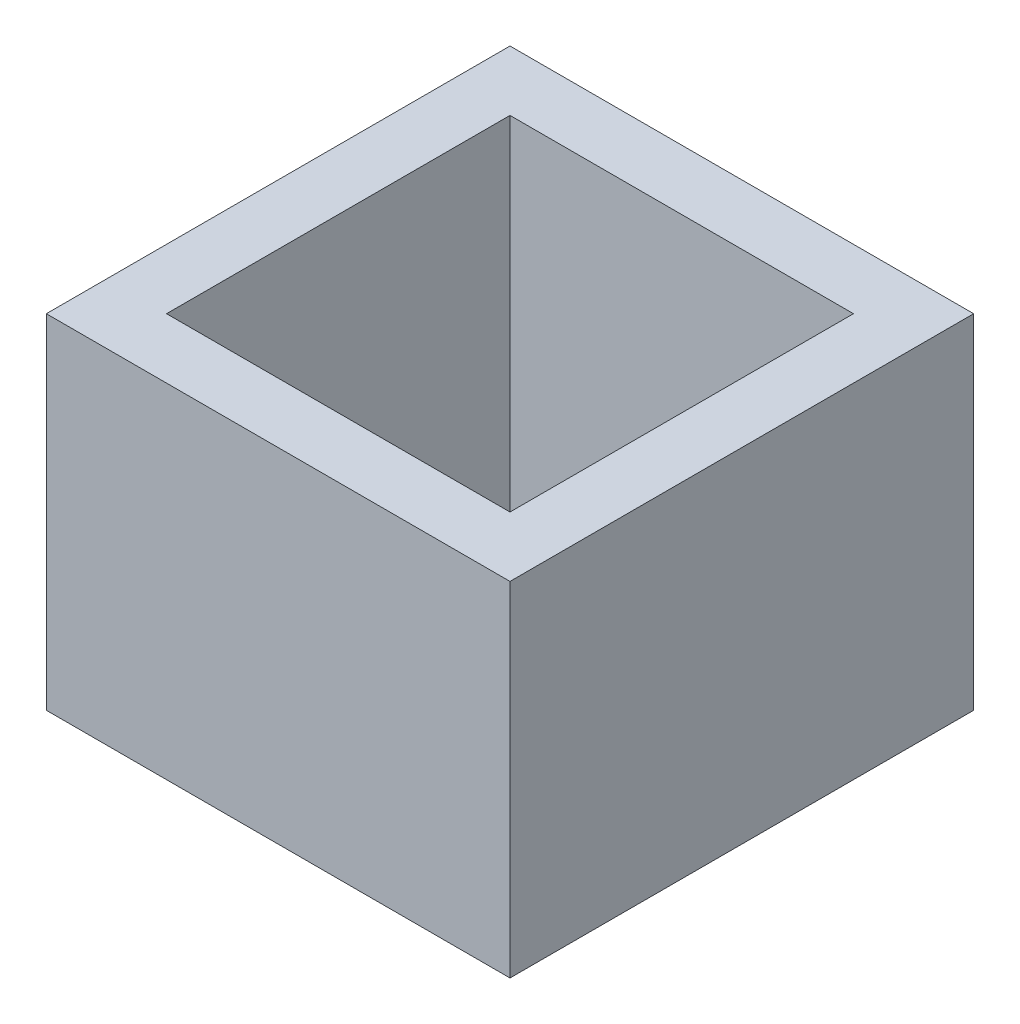
ISO-10303-21;
HEADER;
FILE_DESCRIPTION(('STEP AP214'),'2;1');
FILE_NAME('part.step','',(''),(''),'','','');
FILE_SCHEMA(('AUTOMOTIVE_DESIGN { 1 0 10303 214 1 1 1 1 }'));
ENDSEC;
DATA;
#1=APPLICATION_CONTEXT('core data for automotive mechanical design processes');
#2=APPLICATION_PROTOCOL_DEFINITION('international standard','automotive_design',2000,#1);
#3=PRODUCT_CONTEXT('',#1,'mechanical');
#4=PRODUCT('Part','Part','',(#3));
#5=PRODUCT_RELATED_PRODUCT_CATEGORY('part','',(#4));
#6=PRODUCT_DEFINITION_FORMATION('','',#4);
#7=PRODUCT_DEFINITION_CONTEXT('part definition',#1,'design');
#8=PRODUCT_DEFINITION('design','',#6,#7);
#9=PRODUCT_DEFINITION_SHAPE('','',#8);
#10=(LENGTH_UNIT() NAMED_UNIT(*) SI_UNIT(.MILLI.,.METRE.));
#11=(NAMED_UNIT(*) PLANE_ANGLE_UNIT() SI_UNIT($,.RADIAN.));
#12=(NAMED_UNIT(*) SI_UNIT($,.STERADIAN.) SOLID_ANGLE_UNIT());
#13=UNCERTAINTY_MEASURE_WITH_UNIT(LENGTH_MEASURE(1.E-05),#10,'distance_accuracy_value','');
#14=(GEOMETRIC_REPRESENTATION_CONTEXT(3) GLOBAL_UNCERTAINTY_ASSIGNED_CONTEXT((#13)) GLOBAL_UNIT_ASSIGNED_CONTEXT((#10,
#11,#12)) REPRESENTATION_CONTEXT('',''));
#15=CARTESIAN_POINT('',(0.,0.,0.));
#16=DIRECTION('',(0.,0.,1.));
#17=DIRECTION('',(1.,0.,0.));
#18=AXIS2_PLACEMENT_3D('',#15,#16,#17);
#19=CARTESIAN_POINT('',(0.,10.,0.));
#20=DIRECTION('',(0.,1.,0.));
#21=DIRECTION('',(0.,0.,1.));
#22=AXIS2_PLACEMENT_3D('',#19,#20,#21);
#23=PLANE('',#22);
#24=DIRECTION('',(0.,0.,-1.));
#25=VECTOR('',#24,1.);
#26=CARTESIAN_POINT('',(6.75,10.,6.75));
#27=LINE('',#26,#25);
#28=CARTESIAN_POINT('',(6.75,10.,6.75));
#29=VERTEX_POINT('',#28);
#30=CARTESIAN_POINT('',(6.75,10.,-6.75));
#31=VERTEX_POINT('',#30);
#32=EDGE_CURVE('E134',#29,#31,#27,.T.);
#33=ORIENTED_EDGE('',*,*,#32,.T.);
#34=DIRECTION('',(-1.,0.,0.));
#35=VECTOR('',#34,1.);
#36=CARTESIAN_POINT('',(6.75,10.,-6.75));
#37=LINE('',#36,#35);
#38=CARTESIAN_POINT('',(-6.75,10.,-6.75));
#39=VERTEX_POINT('',#38);
#40=EDGE_CURVE('E137',#31,#39,#37,.T.);
#41=ORIENTED_EDGE('',*,*,#40,.T.);
#42=DIRECTION('',(0.,0.,1.));
#43=VECTOR('',#42,1.);
#44=CARTESIAN_POINT('',(-6.75,10.,6.75));
#45=LINE('',#44,#43);
#46=CARTESIAN_POINT('',(-6.75,10.,6.75));
#47=VERTEX_POINT('',#46);
#48=EDGE_CURVE('E140',#39,#47,#45,.T.);
#49=ORIENTED_EDGE('',*,*,#48,.T.);
#50=DIRECTION('',(1.,0.,0.));
#51=VECTOR('',#50,1.);
#52=CARTESIAN_POINT('',(6.75,10.,6.75));
#53=LINE('',#52,#51);
#54=EDGE_CURVE('E142',#47,#29,#53,.T.);
#55=ORIENTED_EDGE('',*,*,#54,.T.);
#56=EDGE_LOOP('',(#33,#41,#49,#55));
#57=FACE_BOUND('',#56,.T.);
#58=DIRECTION('',(1.,0.,0.));
#59=VECTOR('',#58,1.);
#60=CARTESIAN_POINT('',(5.,10.,5.));
#61=LINE('',#60,#59);
#62=CARTESIAN_POINT('',(-5.,10.,5.));
#63=VERTEX_POINT('',#62);
#64=CARTESIAN_POINT('',(5.,10.,5.));
#65=VERTEX_POINT('',#64);
#66=EDGE_CURVE('E106',#63,#65,#61,.T.);
#67=ORIENTED_EDGE('',*,*,#66,.F.);
#68=DIRECTION('',(0.,0.,1.));
#69=VECTOR('',#68,1.);
#70=CARTESIAN_POINT('',(-5.,10.,5.));
#71=LINE('',#70,#69);
#72=CARTESIAN_POINT('',(-5.,10.,-5.));
#73=VERTEX_POINT('',#72);
#74=EDGE_CURVE('E98',#73,#63,#71,.T.);
#75=ORIENTED_EDGE('',*,*,#74,.F.);
#76=DIRECTION('',(-1.,0.,0.));
#77=VECTOR('',#76,1.);
#78=CARTESIAN_POINT('',(5.,10.,-5.));
#79=LINE('',#78,#77);
#80=CARTESIAN_POINT('',(5.,10.,-5.));
#81=VERTEX_POINT('',#80);
#82=EDGE_CURVE('E120',#81,#73,#79,.T.);
#83=ORIENTED_EDGE('',*,*,#82,.F.);
#84=DIRECTION('',(0.,0.,-1.));
#85=VECTOR('',#84,1.);
#86=CARTESIAN_POINT('',(5.,10.,5.));
#87=LINE('',#86,#85);
#88=EDGE_CURVE('E118',#65,#81,#87,.T.);
#89=ORIENTED_EDGE('',*,*,#88,.F.);
#90=EDGE_LOOP('',(#67,#75,#83,#89));
#91=FACE_BOUND('',#90,.T.);
#92=ADVANCED_FACE('F33',(#57,#91),#23,.T.);
#93=CARTESIAN_POINT('',(0.,0.,0.));
#94=DIRECTION('',(0.,1.,0.));
#95=DIRECTION('',(0.,0.,1.));
#96=AXIS2_PLACEMENT_3D('',#93,#94,#95);
#97=PLANE('',#96);
#98=DIRECTION('',(0.,0.,-1.));
#99=VECTOR('',#98,1.);
#100=CARTESIAN_POINT('',(6.75,0.,6.75));
#101=LINE('',#100,#99);
#102=CARTESIAN_POINT('',(6.75,0.,6.75));
#103=VERTEX_POINT('',#102);
#104=CARTESIAN_POINT('',(6.75,0.,-6.75));
#105=VERTEX_POINT('',#104);
#106=EDGE_CURVE('E114',#103,#105,#101,.T.);
#107=ORIENTED_EDGE('',*,*,#106,.F.);
#108=DIRECTION('',(1.,0.,0.));
#109=VECTOR('',#108,1.);
#110=CARTESIAN_POINT('',(6.75,0.,6.75));
#111=LINE('',#110,#109);
#112=CARTESIAN_POINT('',(-6.75,0.,6.75));
#113=VERTEX_POINT('',#112);
#114=EDGE_CURVE('E138',#113,#103,#111,.T.);
#115=ORIENTED_EDGE('',*,*,#114,.F.);
#116=DIRECTION('',(0.,0.,1.));
#117=VECTOR('',#116,1.);
#118=CARTESIAN_POINT('',(-6.75,0.,6.75));
#119=LINE('',#118,#117);
#120=CARTESIAN_POINT('',(-6.75,0.,-6.75));
#121=VERTEX_POINT('',#120);
#122=EDGE_CURVE('E149',#121,#113,#119,.T.);
#123=ORIENTED_EDGE('',*,*,#122,.F.);
#124=DIRECTION('',(-1.,0.,0.));
#125=VECTOR('',#124,1.);
#126=CARTESIAN_POINT('',(6.75,0.,-6.75));
#127=LINE('',#126,#125);
#128=EDGE_CURVE('E147',#105,#121,#127,.T.);
#129=ORIENTED_EDGE('',*,*,#128,.F.);
#130=EDGE_LOOP('',(#107,#115,#123,#129));
#131=FACE_BOUND('',#130,.T.);
#132=DIRECTION('',(0.,0.,1.));
#133=VECTOR('',#132,1.);
#134=CARTESIAN_POINT('',(-5.,0.,5.));
#135=LINE('',#134,#133);
#136=CARTESIAN_POINT('',(-5.,0.,-5.));
#137=VERTEX_POINT('',#136);
#138=CARTESIAN_POINT('',(-5.,0.,5.));
#139=VERTEX_POINT('',#138);
#140=EDGE_CURVE('E56',#137,#139,#135,.T.);
#141=ORIENTED_EDGE('',*,*,#140,.T.);
#142=DIRECTION('',(1.,0.,0.));
#143=VECTOR('',#142,1.);
#144=CARTESIAN_POINT('',(5.,0.,5.));
#145=LINE('',#144,#143);
#146=CARTESIAN_POINT('',(5.,0.,5.));
#147=VERTEX_POINT('',#146);
#148=EDGE_CURVE('E113',#139,#147,#145,.T.);
#149=ORIENTED_EDGE('',*,*,#148,.T.);
#150=DIRECTION('',(0.,0.,-1.));
#151=VECTOR('',#150,1.);
#152=CARTESIAN_POINT('',(5.,0.,5.));
#153=LINE('',#152,#151);
#154=CARTESIAN_POINT('',(5.,0.,-5.));
#155=VERTEX_POINT('',#154);
#156=EDGE_CURVE('E126',#147,#155,#153,.T.);
#157=ORIENTED_EDGE('',*,*,#156,.T.);
#158=DIRECTION('',(-1.,0.,0.));
#159=VECTOR('',#158,1.);
#160=CARTESIAN_POINT('',(5.,0.,-5.));
#161=LINE('',#160,#159);
#162=EDGE_CURVE('E107',#155,#137,#161,.T.);
#163=ORIENTED_EDGE('',*,*,#162,.T.);
#164=EDGE_LOOP('',(#141,#149,#157,#163));
#165=FACE_BOUND('',#164,.T.);
#166=ADVANCED_FACE('F167',(#131,#165),#97,.F.);
#167=CARTESIAN_POINT('',(6.75,10.,6.75));
#168=DIRECTION('',(-1.,0.,0.));
#169=DIRECTION('',(0.,0.,1.));
#170=AXIS2_PLACEMENT_3D('',#167,#168,#169);
#171=PLANE('',#170);
#172=ORIENTED_EDGE('',*,*,#106,.T.);
#173=DIRECTION('',(0.,-1.,0.));
#174=VECTOR('',#173,1.);
#175=CARTESIAN_POINT('',(6.75,10.,-6.75));
#176=LINE('',#175,#174);
#177=EDGE_CURVE('E11',#31,#105,#176,.T.);
#178=ORIENTED_EDGE('',*,*,#177,.F.);
#179=ORIENTED_EDGE('',*,*,#32,.F.);
#180=DIRECTION('',(0.,-1.,0.));
#181=VECTOR('',#180,1.);
#182=CARTESIAN_POINT('',(6.75,10.,6.75));
#183=LINE('',#182,#181);
#184=EDGE_CURVE('E144',#29,#103,#183,.T.);
#185=ORIENTED_EDGE('',*,*,#184,.T.);
#186=EDGE_LOOP('',(#172,#178,#179,#185));
#187=FACE_BOUND('',#186,.T.);
#188=ADVANCED_FACE('F35',(#187),#171,.F.);
#189=CARTESIAN_POINT('',(6.75,10.,-6.75));
#190=DIRECTION('',(0.,0.,1.));
#191=DIRECTION('',(1.,0.,0.));
#192=AXIS2_PLACEMENT_3D('',#189,#190,#191);
#193=PLANE('',#192);
#194=ORIENTED_EDGE('',*,*,#128,.T.);
#195=DIRECTION('',(0.,-1.,0.));
#196=VECTOR('',#195,1.);
#197=CARTESIAN_POINT('',(-6.75,10.,-6.75));
#198=LINE('',#197,#196);
#199=EDGE_CURVE('E41',#39,#121,#198,.T.);
#200=ORIENTED_EDGE('',*,*,#199,.F.);
#201=ORIENTED_EDGE('',*,*,#40,.F.);
#202=ORIENTED_EDGE('',*,*,#177,.T.);
#203=EDGE_LOOP('',(#194,#200,#201,#202));
#204=FACE_BOUND('',#203,.T.);
#205=ADVANCED_FACE('F177',(#204),#193,.F.);
#206=CARTESIAN_POINT('',(-6.75,10.,6.75));
#207=DIRECTION('',(1.,0.,0.));
#208=DIRECTION('',(0.,0.,-1.));
#209=AXIS2_PLACEMENT_3D('',#206,#207,#208);
#210=PLANE('',#209);
#211=ORIENTED_EDGE('',*,*,#122,.T.);
#212=DIRECTION('',(0.,-1.,0.));
#213=VECTOR('',#212,1.);
#214=CARTESIAN_POINT('',(-6.75,10.,6.75));
#215=LINE('',#214,#213);
#216=EDGE_CURVE('E154',#47,#113,#215,.T.);
#217=ORIENTED_EDGE('',*,*,#216,.F.);
#218=ORIENTED_EDGE('',*,*,#48,.F.);
#219=ORIENTED_EDGE('',*,*,#199,.T.);
#220=EDGE_LOOP('',(#211,#217,#218,#219));
#221=FACE_BOUND('',#220,.T.);
#222=ADVANCED_FACE('F161',(#221),#210,.F.);
#223=CARTESIAN_POINT('',(6.75,10.,6.75));
#224=DIRECTION('',(0.,0.,-1.));
#225=DIRECTION('',(-1.,0.,0.));
#226=AXIS2_PLACEMENT_3D('',#223,#224,#225);
#227=PLANE('',#226);
#228=ORIENTED_EDGE('',*,*,#114,.T.);
#229=ORIENTED_EDGE('',*,*,#184,.F.);
#230=ORIENTED_EDGE('',*,*,#54,.F.);
#231=ORIENTED_EDGE('',*,*,#216,.T.);
#232=EDGE_LOOP('',(#228,#229,#230,#231));
#233=FACE_BOUND('',#232,.T.);
#234=ADVANCED_FACE('F171',(#233),#227,.F.);
#235=CARTESIAN_POINT('',(-5.,10.,5.));
#236=DIRECTION('',(1.,0.,0.));
#237=DIRECTION('',(0.,0.,-1.));
#238=AXIS2_PLACEMENT_3D('',#235,#236,#237);
#239=PLANE('',#238);
#240=ORIENTED_EDGE('',*,*,#140,.F.);
#241=DIRECTION('',(0.,-1.,0.));
#242=VECTOR('',#241,1.);
#243=CARTESIAN_POINT('',(-5.,10.,-5.));
#244=LINE('',#243,#242);
#245=EDGE_CURVE('E102',#73,#137,#244,.T.);
#246=ORIENTED_EDGE('',*,*,#245,.F.);
#247=ORIENTED_EDGE('',*,*,#74,.T.);
#248=DIRECTION('',(0.,-1.,0.));
#249=VECTOR('',#248,1.);
#250=CARTESIAN_POINT('',(-5.,10.,5.));
#251=LINE('',#250,#249);
#252=EDGE_CURVE('E101',#63,#139,#251,.T.);
#253=ORIENTED_EDGE('',*,*,#252,.T.);
#254=EDGE_LOOP('',(#240,#246,#247,#253));
#255=FACE_BOUND('',#254,.T.);
#256=ADVANCED_FACE('F100',(#255),#239,.T.);
#257=CARTESIAN_POINT('',(5.,10.,5.));
#258=DIRECTION('',(0.,0.,-1.));
#259=DIRECTION('',(-1.,0.,0.));
#260=AXIS2_PLACEMENT_3D('',#257,#258,#259);
#261=PLANE('',#260);
#262=ORIENTED_EDGE('',*,*,#148,.F.);
#263=ORIENTED_EDGE('',*,*,#252,.F.);
#264=ORIENTED_EDGE('',*,*,#66,.T.);
#265=DIRECTION('',(0.,-1.,0.));
#266=VECTOR('',#265,1.);
#267=CARTESIAN_POINT('',(5.,10.,5.));
#268=LINE('',#267,#266);
#269=EDGE_CURVE('E115',#65,#147,#268,.T.);
#270=ORIENTED_EDGE('',*,*,#269,.T.);
#271=EDGE_LOOP('',(#262,#263,#264,#270));
#272=FACE_BOUND('',#271,.T.);
#273=ADVANCED_FACE('F110',(#272),#261,.T.);
#274=CARTESIAN_POINT('',(5.,10.,5.));
#275=DIRECTION('',(-1.,0.,0.));
#276=DIRECTION('',(0.,0.,1.));
#277=AXIS2_PLACEMENT_3D('',#274,#275,#276);
#278=PLANE('',#277);
#279=ORIENTED_EDGE('',*,*,#156,.F.);
#280=ORIENTED_EDGE('',*,*,#269,.F.);
#281=ORIENTED_EDGE('',*,*,#88,.T.);
#282=DIRECTION('',(0.,-1.,0.));
#283=VECTOR('',#282,1.);
#284=CARTESIAN_POINT('',(5.,10.,-5.));
#285=LINE('',#284,#283);
#286=EDGE_CURVE('E48',#81,#155,#285,.T.);
#287=ORIENTED_EDGE('',*,*,#286,.T.);
#288=EDGE_LOOP('',(#279,#280,#281,#287));
#289=FACE_BOUND('',#288,.T.);
#290=ADVANCED_FACE('F200',(#289),#278,.T.);
#291=CARTESIAN_POINT('',(5.,10.,-5.));
#292=DIRECTION('',(0.,0.,1.));
#293=DIRECTION('',(1.,0.,0.));
#294=AXIS2_PLACEMENT_3D('',#291,#292,#293);
#295=PLANE('',#294);
#296=ORIENTED_EDGE('',*,*,#162,.F.);
#297=ORIENTED_EDGE('',*,*,#286,.F.);
#298=ORIENTED_EDGE('',*,*,#82,.T.);
#299=ORIENTED_EDGE('',*,*,#245,.T.);
#300=EDGE_LOOP('',(#296,#297,#298,#299));
#301=FACE_BOUND('',#300,.T.);
#302=ADVANCED_FACE('F204',(#301),#295,.T.);
#303=CLOSED_SHELL('',(#92,#166,#188,#205,#222,#234,#256,#273,#290,#302));
#304=MANIFOLD_SOLID_BREP('B2',#303);
#305=ADVANCED_BREP_SHAPE_REPRESENTATION('',(#18,#304),#14);
#306=SHAPE_DEFINITION_REPRESENTATION(#9,#305);
ENDSEC;
END-ISO-10303-21;
